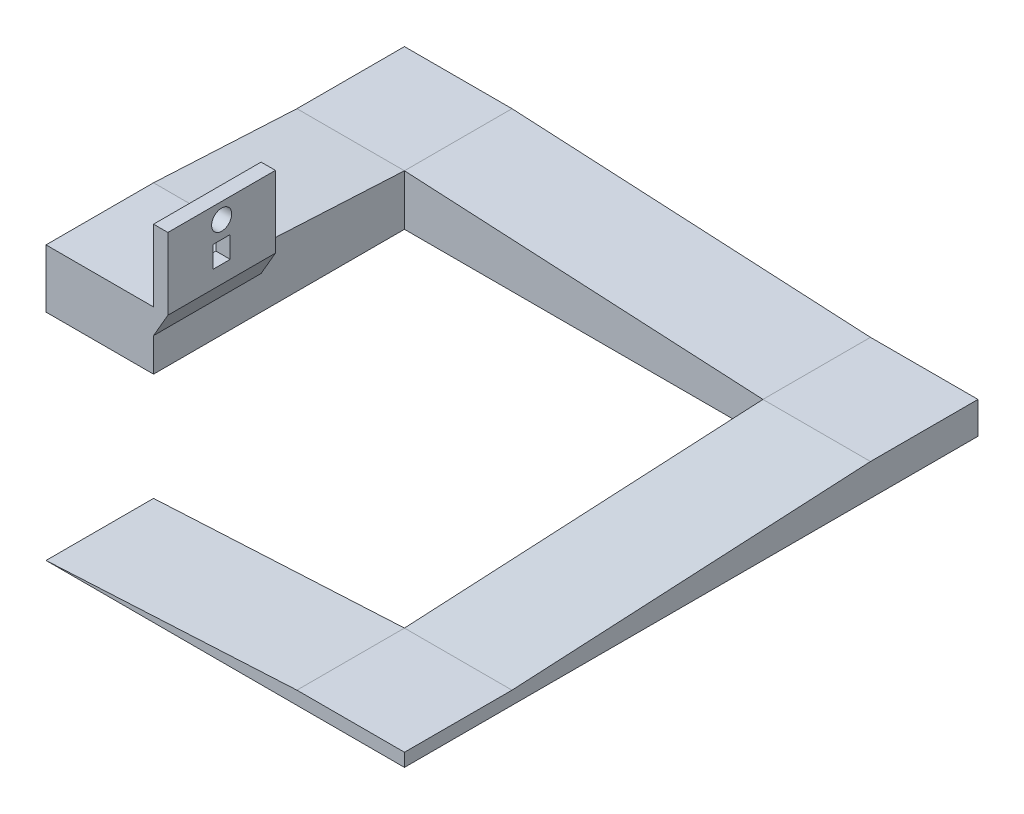
ISO-10303-21;
HEADER;
FILE_DESCRIPTION(('STEP AP214'),'2;1');
FILE_NAME('part.step','',(''),(''),'','','');
FILE_SCHEMA(('AUTOMOTIVE_DESIGN { 1 0 10303 214 1 1 1 1 }'));
ENDSEC;
DATA;
#1=APPLICATION_CONTEXT('core data for automotive mechanical design processes');
#2=APPLICATION_PROTOCOL_DEFINITION('international standard','automotive_design',2000,#1);
#3=PRODUCT_CONTEXT('',#1,'mechanical');
#4=PRODUCT('Part','Part','',(#3));
#5=PRODUCT_RELATED_PRODUCT_CATEGORY('part','',(#4));
#6=PRODUCT_DEFINITION_FORMATION('','',#4);
#7=PRODUCT_DEFINITION_CONTEXT('part definition',#1,'design');
#8=PRODUCT_DEFINITION('design','',#6,#7);
#9=PRODUCT_DEFINITION_SHAPE('','',#8);
#10=(LENGTH_UNIT() NAMED_UNIT(*) SI_UNIT(.MILLI.,.METRE.));
#11=(NAMED_UNIT(*) PLANE_ANGLE_UNIT() SI_UNIT($,.RADIAN.));
#12=(NAMED_UNIT(*) SI_UNIT($,.STERADIAN.) SOLID_ANGLE_UNIT());
#13=UNCERTAINTY_MEASURE_WITH_UNIT(LENGTH_MEASURE(1.E-05),#10,'distance_accuracy_value','');
#14=(GEOMETRIC_REPRESENTATION_CONTEXT(3) GLOBAL_UNCERTAINTY_ASSIGNED_CONTEXT((#13)) GLOBAL_UNIT_ASSIGNED_CONTEXT((#10,
#11,#12)) REPRESENTATION_CONTEXT('',''));
#15=CARTESIAN_POINT('',(0.,0.,0.));
#16=DIRECTION('',(0.,0.,1.));
#17=DIRECTION('',(1.,0.,0.));
#18=AXIS2_PLACEMENT_3D('',#15,#16,#17);
#19=CARTESIAN_POINT('',(0.,0.,0.));
#20=DIRECTION('',(0.,0.,-1.));
#21=DIRECTION('',(-1.,0.,0.));
#22=AXIS2_PLACEMENT_3D('',#19,#20,#21);
#23=PLANE('',#22);
#24=DIRECTION('',(0.998629534754574,0.0523359562429373,0.));
#25=VECTOR('',#24,1.);
#26=CARTESIAN_POINT('',(0.,0.,0.));
#27=LINE('',#26,#25);
#28=CARTESIAN_POINT('',(0.,0.,0.));
#29=VERTEX_POINT('',#28);
#30=CARTESIAN_POINT('',(44.45,2.32952578913089,0.));
#31=VERTEX_POINT('',#30);
#32=EDGE_CURVE('E352',#29,#31,#27,.T.);
#33=ORIENTED_EDGE('',*,*,#32,.T.);
#34=DIRECTION('',(0.,-1.,0.));
#35=VECTOR('',#34,1.);
#36=CARTESIAN_POINT('',(44.45,0.,0.));
#37=LINE('',#36,#35);
#38=CARTESIAN_POINT('',(44.45,0.,0.));
#39=VERTEX_POINT('',#38);
#40=EDGE_CURVE('E306',#31,#39,#37,.T.);
#41=ORIENTED_EDGE('',*,*,#40,.T.);
#42=DIRECTION('',(-1.,0.,0.));
#43=VECTOR('',#42,1.);
#44=CARTESIAN_POINT('',(63.5,0.,0.));
#45=LINE('',#44,#43);
#46=EDGE_CURVE('E315',#39,#29,#45,.T.);
#47=ORIENTED_EDGE('',*,*,#46,.T.);
#48=EDGE_LOOP('',(#33,#41,#47));
#49=FACE_BOUND('',#48,.T.);
#50=ADVANCED_FACE('F35',(#49),#23,.T.);
#51=CARTESIAN_POINT('',(63.5,2.32952578913089,19.05));
#52=DIRECTION('',(1.,0.,0.));
#53=DIRECTION('',(0.,0.,-1.));
#54=AXIS2_PLACEMENT_3D('',#51,#52,#53);
#55=PLANE('',#54);
#56=DIRECTION('',(0.,0.,-1.));
#57=VECTOR('',#56,1.);
#58=CARTESIAN_POINT('',(63.5,0.,19.05));
#59=LINE('',#58,#57);
#60=CARTESIAN_POINT('',(63.5,0.,19.05));
#61=VERTEX_POINT('',#60);
#62=CARTESIAN_POINT('',(63.5,0.,-82.55));
#63=VERTEX_POINT('',#62);
#64=EDGE_CURVE('E349',#61,#63,#59,.T.);
#65=ORIENTED_EDGE('',*,*,#64,.T.);
#66=DIRECTION('',(0.,1.,0.));
#67=VECTOR('',#66,1.);
#68=CARTESIAN_POINT('',(63.5,5.65741977360359,-82.55));
#69=LINE('',#68,#67);
#70=CARTESIAN_POINT('',(63.5,5.65741977360359,-82.55));
#71=VERTEX_POINT('',#70);
#72=EDGE_CURVE('E295',#63,#71,#69,.T.);
#73=ORIENTED_EDGE('',*,*,#72,.T.);
#74=DIRECTION('',(0.,0.,1.));
#75=VECTOR('',#74,1.);
#76=CARTESIAN_POINT('',(63.5,5.65741977360359,-63.5));
#77=LINE('',#76,#75);
#78=CARTESIAN_POINT('',(63.5,5.65741977360359,-63.5));
#79=VERTEX_POINT('',#78);
#80=EDGE_CURVE('E324',#71,#79,#77,.T.);
#81=ORIENTED_EDGE('',*,*,#80,.T.);
#82=DIRECTION('',(0.,-0.0523359562429373,0.998629534754574));
#83=VECTOR('',#82,1.);
#84=CARTESIAN_POINT('',(63.5,2.32952578913089,0.));
#85=LINE('',#84,#83);
#86=CARTESIAN_POINT('',(63.5,2.32952578913089,0.));
#87=VERTEX_POINT('',#86);
#88=EDGE_CURVE('E319',#79,#87,#85,.T.);
#89=ORIENTED_EDGE('',*,*,#88,.T.);
#90=DIRECTION('',(0.,0.,-1.));
#91=VECTOR('',#90,1.);
#92=CARTESIAN_POINT('',(63.5,2.32952578913089,19.05));
#93=LINE('',#92,#91);
#94=CARTESIAN_POINT('',(63.5,2.32952578913089,19.05));
#95=VERTEX_POINT('',#94);
#96=EDGE_CURVE('E43',#95,#87,#93,.T.);
#97=ORIENTED_EDGE('',*,*,#96,.F.);
#98=DIRECTION('',(0.,-1.,0.));
#99=VECTOR('',#98,1.);
#100=CARTESIAN_POINT('',(63.5,2.32952578913089,19.05));
#101=LINE('',#100,#99);
#102=EDGE_CURVE('E337',#95,#61,#101,.T.);
#103=ORIENTED_EDGE('',*,*,#102,.T.);
#104=EDGE_LOOP('',(#65,#73,#81,#89,#97,#103));
#105=FACE_BOUND('',#104,.T.);
#106=ADVANCED_FACE('F37',(#105),#55,.T.);
#107=CARTESIAN_POINT('',(44.45,2.32952578913089,19.05));
#108=DIRECTION('',(0.,1.,0.));
#109=DIRECTION('',(0.,0.,1.));
#110=AXIS2_PLACEMENT_3D('',#107,#108,#109);
#111=PLANE('',#110);
#112=DIRECTION('',(1.,0.,0.));
#113=VECTOR('',#112,1.);
#114=CARTESIAN_POINT('',(44.45,2.32952578913089,0.));
#115=LINE('',#114,#113);
#116=EDGE_CURVE('E341',#31,#87,#115,.T.);
#117=ORIENTED_EDGE('',*,*,#116,.F.);
#118=DIRECTION('',(0.,0.,-1.));
#119=VECTOR('',#118,1.);
#120=CARTESIAN_POINT('',(44.45,2.32952578913089,19.05));
#121=LINE('',#120,#119);
#122=CARTESIAN_POINT('',(44.45,2.32952578913089,19.05));
#123=VERTEX_POINT('',#122);
#124=EDGE_CURVE('E357',#123,#31,#121,.T.);
#125=ORIENTED_EDGE('',*,*,#124,.F.);
#126=DIRECTION('',(1.,0.,0.));
#127=VECTOR('',#126,1.);
#128=CARTESIAN_POINT('',(44.45,2.32952578913089,19.05));
#129=LINE('',#128,#127);
#130=EDGE_CURVE('E347',#123,#95,#129,.T.);
#131=ORIENTED_EDGE('',*,*,#130,.T.);
#132=ORIENTED_EDGE('',*,*,#96,.T.);
#133=EDGE_LOOP('',(#117,#125,#131,#132));
#134=FACE_BOUND('',#133,.T.);
#135=ADVANCED_FACE('F383',(#134),#111,.T.);
#136=CARTESIAN_POINT('',(0.,0.,19.05));
#137=DIRECTION('',(-0.0523359562429373,0.998629534754574,0.));
#138=DIRECTION('',(-0.998629534754574,-0.0523359562429373,0.));
#139=AXIS2_PLACEMENT_3D('',#136,#137,#138);
#140=PLANE('',#139);
#141=ORIENTED_EDGE('',*,*,#32,.F.);
#142=DIRECTION('',(0.,0.,-1.));
#143=VECTOR('',#142,1.);
#144=CARTESIAN_POINT('',(0.,0.,19.05));
#145=LINE('',#144,#143);
#146=CARTESIAN_POINT('',(0.,0.,19.05));
#147=VERTEX_POINT('',#146);
#148=EDGE_CURVE('E360',#147,#29,#145,.T.);
#149=ORIENTED_EDGE('',*,*,#148,.F.);
#150=DIRECTION('',(0.998629534754574,0.0523359562429373,0.));
#151=VECTOR('',#150,1.);
#152=CARTESIAN_POINT('',(0.,0.,19.05));
#153=LINE('',#152,#151);
#154=EDGE_CURVE('E344',#147,#123,#153,.T.);
#155=ORIENTED_EDGE('',*,*,#154,.T.);
#156=ORIENTED_EDGE('',*,*,#124,.T.);
#157=EDGE_LOOP('',(#141,#149,#155,#156));
#158=FACE_BOUND('',#157,.T.);
#159=ADVANCED_FACE('F390',(#158),#140,.T.);
#160=CARTESIAN_POINT('',(63.5,0.,19.05));
#161=DIRECTION('',(0.,-1.,0.));
#162=DIRECTION('',(1.,0.,0.));
#163=AXIS2_PLACEMENT_3D('',#160,#161,#162);
#164=PLANE('',#163);
#165=ORIENTED_EDGE('',*,*,#46,.F.);
#166=DIRECTION('',(0.,0.,-1.));
#167=VECTOR('',#166,1.);
#168=CARTESIAN_POINT('',(44.45,0.,-82.55));
#169=LINE('',#168,#167);
#170=CARTESIAN_POINT('',(44.45,0.,-63.5));
#171=VERTEX_POINT('',#170);
#172=EDGE_CURVE('E304',#39,#171,#169,.T.);
#173=ORIENTED_EDGE('',*,*,#172,.T.);
#174=DIRECTION('',(-1.,0.,0.));
#175=VECTOR('',#174,1.);
#176=CARTESIAN_POINT('',(-38.1,0.,-63.5));
#177=LINE('',#176,#175);
#178=CARTESIAN_POINT('',(-19.05,0.,-63.5));
#179=VERTEX_POINT('',#178);
#180=EDGE_CURVE('E274',#171,#179,#177,.T.);
#181=ORIENTED_EDGE('',*,*,#180,.T.);
#182=DIRECTION('',(0.,0.,1.));
#183=VECTOR('',#182,1.);
#184=CARTESIAN_POINT('',(-19.05,0.,-19.05));
#185=LINE('',#184,#183);
#186=CARTESIAN_POINT('',(-19.05,0.,-19.05));
#187=VERTEX_POINT('',#186);
#188=EDGE_CURVE('E247',#179,#187,#185,.T.);
#189=ORIENTED_EDGE('',*,*,#188,.T.);
#190=DIRECTION('',(-1.,0.,0.));
#191=VECTOR('',#190,1.);
#192=CARTESIAN_POINT('',(-19.05,0.,-19.05));
#193=LINE('',#192,#191);
#194=CARTESIAN_POINT('',(-38.1,0.,-19.05));
#195=VERTEX_POINT('',#194);
#196=EDGE_CURVE('E260',#187,#195,#193,.T.);
#197=ORIENTED_EDGE('',*,*,#196,.T.);
#198=DIRECTION('',(0.,0.,-1.));
#199=VECTOR('',#198,1.);
#200=CARTESIAN_POINT('',(-38.1,0.,-63.5));
#201=LINE('',#200,#199);
#202=CARTESIAN_POINT('',(-38.1,0.,-82.55));
#203=VERTEX_POINT('',#202);
#204=EDGE_CURVE('E286',#195,#203,#201,.T.);
#205=ORIENTED_EDGE('',*,*,#204,.T.);
#206=DIRECTION('',(1.,0.,0.));
#207=VECTOR('',#206,1.);
#208=CARTESIAN_POINT('',(44.45,0.,-82.55));
#209=LINE('',#208,#207);
#210=EDGE_CURVE('E314',#203,#63,#209,.T.);
#211=ORIENTED_EDGE('',*,*,#210,.T.);
#212=ORIENTED_EDGE('',*,*,#64,.F.);
#213=DIRECTION('',(-1.,0.,0.));
#214=VECTOR('',#213,1.);
#215=CARTESIAN_POINT('',(63.5,0.,19.05));
#216=LINE('',#215,#214);
#217=EDGE_CURVE('E340',#61,#147,#216,.T.);
#218=ORIENTED_EDGE('',*,*,#217,.T.);
#219=ORIENTED_EDGE('',*,*,#148,.T.);
#220=EDGE_LOOP('',(#165,#173,#181,#189,#197,#205,#211,#212,#218,#219));
#221=FACE_BOUND('',#220,.T.);
#222=ADVANCED_FACE('F366',(#221),#164,.T.);
#223=CARTESIAN_POINT('',(0.,0.,19.05));
#224=DIRECTION('',(0.,0.,-1.));
#225=DIRECTION('',(-1.,0.,0.));
#226=AXIS2_PLACEMENT_3D('',#223,#224,#225);
#227=PLANE('',#226);
#228=ORIENTED_EDGE('',*,*,#102,.F.);
#229=ORIENTED_EDGE('',*,*,#130,.F.);
#230=ORIENTED_EDGE('',*,*,#154,.F.);
#231=ORIENTED_EDGE('',*,*,#217,.F.);
#232=EDGE_LOOP('',(#228,#229,#230,#231));
#233=FACE_BOUND('',#232,.T.);
#234=ADVANCED_FACE('F386',(#233),#227,.F.);
#235=CARTESIAN_POINT('',(44.45,2.32952578913089,0.));
#236=DIRECTION('',(0.,0.998629534754574,0.0523359562429373));
#237=DIRECTION('',(0.,-0.0523359562429373,0.998629534754574));
#238=AXIS2_PLACEMENT_3D('',#235,#236,#237);
#239=PLANE('',#238);
#240=ORIENTED_EDGE('',*,*,#88,.F.);
#241=DIRECTION('',(1.,0.,0.));
#242=VECTOR('',#241,1.);
#243=CARTESIAN_POINT('',(44.45,5.65741977360359,-63.5));
#244=LINE('',#243,#242);
#245=CARTESIAN_POINT('',(44.45,5.65741977360359,-63.5));
#246=VERTEX_POINT('',#245);
#247=EDGE_CURVE('E331',#246,#79,#244,.T.);
#248=ORIENTED_EDGE('',*,*,#247,.F.);
#249=DIRECTION('',(0.,-0.0523359562429373,0.998629534754574));
#250=VECTOR('',#249,1.);
#251=CARTESIAN_POINT('',(44.45,2.32952578913089,0.));
#252=LINE('',#251,#250);
#253=EDGE_CURVE('E303',#246,#31,#252,.T.);
#254=ORIENTED_EDGE('',*,*,#253,.T.);
#255=ORIENTED_EDGE('',*,*,#116,.T.);
#256=EDGE_LOOP('',(#240,#248,#254,#255));
#257=FACE_BOUND('',#256,.T.);
#258=ADVANCED_FACE('F379',(#257),#239,.T.);
#259=CARTESIAN_POINT('',(44.45,5.65741977360359,-63.5));
#260=DIRECTION('',(0.,1.,0.));
#261=DIRECTION('',(0.,0.,1.));
#262=AXIS2_PLACEMENT_3D('',#259,#260,#261);
#263=PLANE('',#262);
#264=ORIENTED_EDGE('',*,*,#80,.F.);
#265=DIRECTION('',(1.,0.,0.));
#266=VECTOR('',#265,1.);
#267=CARTESIAN_POINT('',(44.45,5.65741977360359,-82.55));
#268=LINE('',#267,#266);
#269=CARTESIAN_POINT('',(44.45,5.65741977360359,-82.55));
#270=VERTEX_POINT('',#269);
#271=EDGE_CURVE('E333',#270,#71,#268,.T.);
#272=ORIENTED_EDGE('',*,*,#271,.F.);
#273=DIRECTION('',(0.,0.,1.));
#274=VECTOR('',#273,1.);
#275=CARTESIAN_POINT('',(44.45,5.65741977360359,-63.5));
#276=LINE('',#275,#274);
#277=EDGE_CURVE('E300',#270,#246,#276,.T.);
#278=ORIENTED_EDGE('',*,*,#277,.T.);
#279=ORIENTED_EDGE('',*,*,#247,.T.);
#280=EDGE_LOOP('',(#264,#272,#278,#279));
#281=FACE_BOUND('',#280,.T.);
#282=ADVANCED_FACE('F375',(#281),#263,.T.);
#283=CARTESIAN_POINT('',(44.45,5.65741977360359,-82.55));
#284=DIRECTION('',(0.,0.,-1.));
#285=DIRECTION('',(-1.,0.,0.));
#286=AXIS2_PLACEMENT_3D('',#283,#284,#285);
#287=PLANE('',#286);
#288=ORIENTED_EDGE('',*,*,#72,.F.);
#289=ORIENTED_EDGE('',*,*,#210,.F.);
#290=DIRECTION('',(0.,1.,0.));
#291=VECTOR('',#290,1.);
#292=CARTESIAN_POINT('',(-38.1,8.98531375807628,-82.55));
#293=LINE('',#292,#291);
#294=CARTESIAN_POINT('',(-38.1,8.98531375807628,-82.55));
#295=VERTEX_POINT('',#294);
#296=EDGE_CURVE('E269',#203,#295,#293,.T.);
#297=ORIENTED_EDGE('',*,*,#296,.T.);
#298=DIRECTION('',(1.,0.,0.));
#299=VECTOR('',#298,1.);
#300=CARTESIAN_POINT('',(-19.05,8.98531375807628,-82.55));
#301=LINE('',#300,#299);
#302=CARTESIAN_POINT('',(-19.05,8.98531375807628,-82.55));
#303=VERTEX_POINT('',#302);
#304=EDGE_CURVE('E289',#295,#303,#301,.T.);
#305=ORIENTED_EDGE('',*,*,#304,.T.);
#306=DIRECTION('',(0.998629534754574,-0.0523359562429372,0.));
#307=VECTOR('',#306,1.);
#308=CARTESIAN_POINT('',(44.45,5.65741977360359,-82.55));
#309=LINE('',#308,#307);
#310=EDGE_CURVE('E278',#303,#270,#309,.T.);
#311=ORIENTED_EDGE('',*,*,#310,.T.);
#312=ORIENTED_EDGE('',*,*,#271,.T.);
#313=EDGE_LOOP('',(#288,#289,#297,#305,#311,#312));
#314=FACE_BOUND('',#313,.T.);
#315=ADVANCED_FACE('F369',(#314),#287,.T.);
#316=CARTESIAN_POINT('',(44.45,0.,0.));
#317=DIRECTION('',(-1.,0.,0.));
#318=DIRECTION('',(0.,0.,1.));
#319=AXIS2_PLACEMENT_3D('',#316,#317,#318);
#320=PLANE('',#319);
#321=DIRECTION('',(0.,-1.,0.));
#322=VECTOR('',#321,1.);
#323=CARTESIAN_POINT('',(44.45,0.,-63.5));
#324=LINE('',#323,#322);
#325=EDGE_CURVE('E283',#246,#171,#324,.T.);
#326=ORIENTED_EDGE('',*,*,#325,.T.);
#327=ORIENTED_EDGE('',*,*,#172,.F.);
#328=ORIENTED_EDGE('',*,*,#40,.F.);
#329=ORIENTED_EDGE('',*,*,#253,.F.);
#330=EDGE_LOOP('',(#326,#327,#328,#329));
#331=FACE_BOUND('',#330,.T.);
#332=ADVANCED_FACE('F393',(#331),#320,.T.);
#333=CARTESIAN_POINT('',(44.45,5.65741977360359,-63.5));
#334=DIRECTION('',(0.0523359562429372,0.998629534754574,0.));
#335=DIRECTION('',(-0.998629534754574,0.0523359562429373,0.));
#336=AXIS2_PLACEMENT_3D('',#333,#334,#335);
#337=PLANE('',#336);
#338=ORIENTED_EDGE('',*,*,#310,.F.);
#339=DIRECTION('',(0.,0.,-1.));
#340=VECTOR('',#339,1.);
#341=CARTESIAN_POINT('',(-19.05,8.98531375807628,-63.5));
#342=LINE('',#341,#340);
#343=CARTESIAN_POINT('',(-19.05,8.98531375807628,-63.5));
#344=VERTEX_POINT('',#343);
#345=EDGE_CURVE('E293',#344,#303,#342,.T.);
#346=ORIENTED_EDGE('',*,*,#345,.F.);
#347=DIRECTION('',(0.998629534754574,-0.0523359562429372,0.));
#348=VECTOR('',#347,1.);
#349=CARTESIAN_POINT('',(44.45,5.65741977360359,-63.5));
#350=LINE('',#349,#348);
#351=EDGE_CURVE('E281',#344,#246,#350,.T.);
#352=ORIENTED_EDGE('',*,*,#351,.T.);
#353=ORIENTED_EDGE('',*,*,#277,.F.);
#354=EDGE_LOOP('',(#338,#346,#352,#353));
#355=FACE_BOUND('',#354,.T.);
#356=ADVANCED_FACE('F419',(#355),#337,.T.);
#357=CARTESIAN_POINT('',(-19.05,8.98531375807628,-63.5));
#358=DIRECTION('',(0.,1.,0.));
#359=DIRECTION('',(0.,0.,1.));
#360=AXIS2_PLACEMENT_3D('',#357,#358,#359);
#361=PLANE('',#360);
#362=ORIENTED_EDGE('',*,*,#304,.F.);
#363=DIRECTION('',(0.,0.,-1.));
#364=VECTOR('',#363,1.);
#365=CARTESIAN_POINT('',(-38.1,8.98531375807628,-63.5));
#366=LINE('',#365,#364);
#367=CARTESIAN_POINT('',(-38.1,8.98531375807628,-63.5));
#368=VERTEX_POINT('',#367);
#369=EDGE_CURVE('E296',#368,#295,#366,.T.);
#370=ORIENTED_EDGE('',*,*,#369,.F.);
#371=DIRECTION('',(1.,0.,0.));
#372=VECTOR('',#371,1.);
#373=CARTESIAN_POINT('',(-19.05,8.98531375807628,-63.5));
#374=LINE('',#373,#372);
#375=EDGE_CURVE('E277',#368,#344,#374,.T.);
#376=ORIENTED_EDGE('',*,*,#375,.T.);
#377=ORIENTED_EDGE('',*,*,#345,.T.);
#378=EDGE_LOOP('',(#362,#370,#376,#377));
#379=FACE_BOUND('',#378,.T.);
#380=ADVANCED_FACE('F415',(#379),#361,.T.);
#381=CARTESIAN_POINT('',(-38.1,8.98531375807628,-63.5));
#382=DIRECTION('',(-1.,0.,0.));
#383=DIRECTION('',(0.,0.,1.));
#384=AXIS2_PLACEMENT_3D('',#381,#382,#383);
#385=PLANE('',#384);
#386=ORIENTED_EDGE('',*,*,#296,.F.);
#387=ORIENTED_EDGE('',*,*,#204,.F.);
#388=DIRECTION('',(0.,1.,0.));
#389=VECTOR('',#388,1.);
#390=CARTESIAN_POINT('',(-38.1,10.3164713518654,-19.05));
#391=LINE('',#390,#389);
#392=CARTESIAN_POINT('',(-38.1,10.3164713518654,-19.05));
#393=VERTEX_POINT('',#392);
#394=EDGE_CURVE('E237',#195,#393,#391,.T.);
#395=ORIENTED_EDGE('',*,*,#394,.T.);
#396=DIRECTION('',(0.,0.,-1.));
#397=VECTOR('',#396,1.);
#398=CARTESIAN_POINT('',(-38.1,10.3164713518654,-38.1));
#399=LINE('',#398,#397);
#400=CARTESIAN_POINT('',(-38.1,10.3164713518654,-38.1));
#401=VERTEX_POINT('',#400);
#402=EDGE_CURVE('E263',#393,#401,#399,.T.);
#403=ORIENTED_EDGE('',*,*,#402,.T.);
#404=DIRECTION('',(0.,-0.0523359562429373,-0.998629534754574));
#405=VECTOR('',#404,1.);
#406=CARTESIAN_POINT('',(-38.1,8.98531375807628,-63.5));
#407=LINE('',#406,#405);
#408=EDGE_CURVE('E248',#401,#368,#407,.T.);
#409=ORIENTED_EDGE('',*,*,#408,.T.);
#410=ORIENTED_EDGE('',*,*,#369,.T.);
#411=EDGE_LOOP('',(#386,#387,#395,#403,#409,#410));
#412=FACE_BOUND('',#411,.T.);
#413=ADVANCED_FACE('F410',(#412),#385,.T.);
#414=CARTESIAN_POINT('',(0.,0.,-63.5));
#415=DIRECTION('',(0.,0.,1.));
#416=DIRECTION('',(1.,0.,0.));
#417=AXIS2_PLACEMENT_3D('',#414,#415,#416);
#418=PLANE('',#417);
#419=DIRECTION('',(0.,-1.,0.));
#420=VECTOR('',#419,1.);
#421=CARTESIAN_POINT('',(-19.05,0.,-63.5));
#422=LINE('',#421,#420);
#423=EDGE_CURVE('E244',#344,#179,#422,.T.);
#424=ORIENTED_EDGE('',*,*,#423,.T.);
#425=ORIENTED_EDGE('',*,*,#180,.F.);
#426=ORIENTED_EDGE('',*,*,#325,.F.);
#427=ORIENTED_EDGE('',*,*,#351,.F.);
#428=EDGE_LOOP('',(#424,#425,#426,#427));
#429=FACE_BOUND('',#428,.T.);
#430=ADVANCED_FACE('F397',(#429),#418,.T.);
#431=CARTESIAN_POINT('',(-19.05,8.98531375807628,-63.5));
#432=DIRECTION('',(0.,0.998629534754574,-0.0523359562429373));
#433=DIRECTION('',(0.,0.0523359562429373,0.998629534754574));
#434=AXIS2_PLACEMENT_3D('',#431,#432,#433);
#435=PLANE('',#434);
#436=ORIENTED_EDGE('',*,*,#408,.F.);
#437=DIRECTION('',(-1.,0.,0.));
#438=VECTOR('',#437,1.);
#439=CARTESIAN_POINT('',(-19.05,10.3164713518654,-38.1));
#440=LINE('',#439,#438);
#441=CARTESIAN_POINT('',(-19.05,10.3164713518654,-38.1));
#442=VERTEX_POINT('',#441);
#443=EDGE_CURVE('E267',#442,#401,#440,.T.);
#444=ORIENTED_EDGE('',*,*,#443,.F.);
#445=DIRECTION('',(0.,-0.0523359562429373,-0.998629534754574));
#446=VECTOR('',#445,1.);
#447=CARTESIAN_POINT('',(-19.05,8.98531375807628,-63.5));
#448=LINE('',#447,#446);
#449=EDGE_CURVE('E257',#442,#344,#448,.T.);
#450=ORIENTED_EDGE('',*,*,#449,.T.);
#451=ORIENTED_EDGE('',*,*,#375,.F.);
#452=EDGE_LOOP('',(#436,#444,#450,#451));
#453=FACE_BOUND('',#452,.T.);
#454=ADVANCED_FACE('F496',(#453),#435,.T.);
#455=CARTESIAN_POINT('',(-19.05,10.3164713518654,-38.1));
#456=DIRECTION('',(0.,1.,0.));
#457=DIRECTION('',(0.,0.,1.));
#458=AXIS2_PLACEMENT_3D('',#455,#456,#457);
#459=PLANE('',#458);
#460=ORIENTED_EDGE('',*,*,#402,.F.);
#461=DIRECTION('',(-1.,0.,0.));
#462=VECTOR('',#461,1.);
#463=CARTESIAN_POINT('',(-19.05,10.3164713518654,-19.05));
#464=LINE('',#463,#462);
#465=CARTESIAN_POINT('',(-19.05,10.3164713518654,-19.05));
#466=VERTEX_POINT('',#465);
#467=EDGE_CURVE('E270',#466,#393,#464,.T.);
#468=ORIENTED_EDGE('',*,*,#467,.F.);
#469=DIRECTION('',(0.,0.,-1.));
#470=VECTOR('',#469,1.);
#471=CARTESIAN_POINT('',(-19.05,10.3164713518654,-38.1));
#472=LINE('',#471,#470);
#473=EDGE_CURVE('E254',#466,#442,#472,.T.);
#474=ORIENTED_EDGE('',*,*,#473,.T.);
#475=ORIENTED_EDGE('',*,*,#443,.T.);
#476=EDGE_LOOP('',(#460,#468,#474,#475));
#477=FACE_BOUND('',#476,.T.);
#478=ADVANCED_FACE('F503',(#477),#459,.T.);
#479=CARTESIAN_POINT('',(-19.05,10.3164713518654,-19.05));
#480=DIRECTION('',(0.,0.,1.));
#481=DIRECTION('',(1.,0.,0.));
#482=AXIS2_PLACEMENT_3D('',#479,#480,#481);
#483=PLANE('',#482);
#484=ORIENTED_EDGE('',*,*,#394,.F.);
#485=ORIENTED_EDGE('',*,*,#196,.F.);
#486=DIRECTION('',(0.,1.,0.));
#487=VECTOR('',#486,1.);
#488=CARTESIAN_POINT('',(-19.05,10.3164713518654,-19.05));
#489=LINE('',#488,#487);
#490=CARTESIAN_POINT('',(-19.05,5.91706230064037,-19.05));
#491=VERTEX_POINT('',#490);
#492=EDGE_CURVE('E251',#187,#491,#489,.T.);
#493=ORIENTED_EDGE('',*,*,#492,.T.);
#494=DIRECTION('',(0.499999999999995,0.866025403784441,0.));
#495=VECTOR('',#494,1.);
#496=CARTESIAN_POINT('',(-16.51,10.3164713518654,-19.05));
#497=LINE('',#496,#495);
#498=CARTESIAN_POINT('',(-16.51,10.3164713518654,-19.05));
#499=VERTEX_POINT('',#498);
#500=EDGE_CURVE('E230',#491,#499,#497,.T.);
#501=ORIENTED_EDGE('',*,*,#500,.T.);
#502=DIRECTION('',(0.,1.,0.));
#503=VECTOR('',#502,1.);
#504=CARTESIAN_POINT('',(-16.51,23.0164713518654,-19.05));
#505=LINE('',#504,#503);
#506=CARTESIAN_POINT('',(-16.51,23.0164713518654,-19.05));
#507=VERTEX_POINT('',#506);
#508=EDGE_CURVE('E216',#499,#507,#505,.T.);
#509=ORIENTED_EDGE('',*,*,#508,.T.);
#510=DIRECTION('',(-1.,0.,0.));
#511=VECTOR('',#510,1.);
#512=CARTESIAN_POINT('',(-19.05,23.0164713518654,-19.05));
#513=LINE('',#512,#511);
#514=CARTESIAN_POINT('',(-19.05,23.0164713518654,-19.05));
#515=VERTEX_POINT('',#514);
#516=EDGE_CURVE('E183',#507,#515,#513,.T.);
#517=ORIENTED_EDGE('',*,*,#516,.T.);
#518=DIRECTION('',(0.,-1.,0.));
#519=VECTOR('',#518,1.);
#520=CARTESIAN_POINT('',(-19.05,5.91706230064037,-19.05));
#521=LINE('',#520,#519);
#522=EDGE_CURVE('E228',#515,#466,#521,.T.);
#523=ORIENTED_EDGE('',*,*,#522,.T.);
#524=ORIENTED_EDGE('',*,*,#467,.T.);
#525=EDGE_LOOP('',(#484,#485,#493,#501,#509,#517,#523,#524));
#526=FACE_BOUND('',#525,.T.);
#527=ADVANCED_FACE('F405',(#526),#483,.T.);
#528=CARTESIAN_POINT('',(-19.05,0.,0.));
#529=DIRECTION('',(1.,0.,0.));
#530=DIRECTION('',(0.,0.,-1.));
#531=AXIS2_PLACEMENT_3D('',#528,#529,#530);
#532=PLANE('',#531);
#533=DIRECTION('',(0.,0.,1.));
#534=VECTOR('',#533,1.);
#535=CARTESIAN_POINT('',(-19.05,5.91706230064037,-38.1));
#536=LINE('',#535,#534);
#537=CARTESIAN_POINT('',(-19.05,5.91706230064037,-38.1));
#538=VERTEX_POINT('',#537);
#539=EDGE_CURVE('E240',#538,#491,#536,.T.);
#540=ORIENTED_EDGE('',*,*,#539,.T.);
#541=ORIENTED_EDGE('',*,*,#492,.F.);
#542=ORIENTED_EDGE('',*,*,#188,.F.);
#543=ORIENTED_EDGE('',*,*,#423,.F.);
#544=ORIENTED_EDGE('',*,*,#449,.F.);
#545=DIRECTION('',(0.,1.,0.));
#546=VECTOR('',#545,1.);
#547=CARTESIAN_POINT('',(-19.05,0.,-38.1));
#548=LINE('',#547,#546);
#549=EDGE_CURVE('E11',#538,#442,#548,.T.);
#550=ORIENTED_EDGE('',*,*,#549,.F.);
#551=EDGE_LOOP('',(#540,#541,#542,#543,#544,#550));
#552=FACE_BOUND('',#551,.T.);
#553=ADVANCED_FACE('F401',(#552),#532,.T.);
#554=CARTESIAN_POINT('',(-19.05,23.0164713518654,-38.1));
#555=DIRECTION('',(0.,1.,0.));
#556=DIRECTION('',(-1.,0.,0.));
#557=AXIS2_PLACEMENT_3D('',#554,#555,#556);
#558=PLANE('',#557);
#559=ORIENTED_EDGE('',*,*,#516,.F.);
#560=DIRECTION('',(0.,0.,1.));
#561=VECTOR('',#560,1.);
#562=CARTESIAN_POINT('',(-16.51,23.0164713518654,-38.1));
#563=LINE('',#562,#561);
#564=CARTESIAN_POINT('',(-16.51,23.0164713518654,-38.1));
#565=VERTEX_POINT('',#564);
#566=EDGE_CURVE('E235',#565,#507,#563,.T.);
#567=ORIENTED_EDGE('',*,*,#566,.F.);
#568=DIRECTION('',(-1.,0.,0.));
#569=VECTOR('',#568,1.);
#570=CARTESIAN_POINT('',(-19.05,23.0164713518654,-38.1));
#571=LINE('',#570,#569);
#572=CARTESIAN_POINT('',(-19.05,23.0164713518654,-38.1));
#573=VERTEX_POINT('',#572);
#574=EDGE_CURVE('E212',#565,#573,#571,.T.);
#575=ORIENTED_EDGE('',*,*,#574,.T.);
#576=DIRECTION('',(0.,0.,1.));
#577=VECTOR('',#576,1.);
#578=CARTESIAN_POINT('',(-19.05,23.0164713518654,-38.1));
#579=LINE('',#578,#577);
#580=EDGE_CURVE('E225',#573,#515,#579,.T.);
#581=ORIENTED_EDGE('',*,*,#580,.T.);
#582=EDGE_LOOP('',(#559,#567,#575,#581));
#583=FACE_BOUND('',#582,.T.);
#584=ADVANCED_FACE('F532',(#583),#558,.T.);
#585=CARTESIAN_POINT('',(-16.51,23.0164713518654,-38.1));
#586=DIRECTION('',(1.,0.,0.));
#587=DIRECTION('',(0.,0.,-1.));
#588=AXIS2_PLACEMENT_3D('',#585,#586,#587);
#589=PLANE('',#588);
#590=CARTESIAN_POINT('',(-16.51,20.2224713518654,-28.575));
#591=DIRECTION('',(1.,0.,0.));
#592=DIRECTION('',(0.,0.,-1.));
#593=AXIS2_PLACEMENT_3D('',#590,#591,#592);
#594=CIRCLE('',#593,1.778);
#595=CARTESIAN_POINT('',(-16.51,20.2224713518654,-30.353));
#596=VERTEX_POINT('',#595);
#597=EDGE_CURVE('E632',#596,#596,#594,.F.);
#598=ORIENTED_EDGE('',*,*,#597,.T.);
#599=EDGE_LOOP('',(#598));
#600=FACE_BOUND('',#599,.T.);
#601=DIRECTION('',(0.,-1.,0.));
#602=VECTOR('',#601,1.);
#603=CARTESIAN_POINT('',(-16.51,17.1744713518654,-30.099));
#604=LINE('',#603,#602);
#605=CARTESIAN_POINT('',(-16.51,17.1744713518654,-30.099));
#606=VERTEX_POINT('',#605);
#607=CARTESIAN_POINT('',(-16.51,13.3644713518654,-30.099));
#608=VERTEX_POINT('',#607);
#609=EDGE_CURVE('E187',#606,#608,#604,.T.);
#610=ORIENTED_EDGE('',*,*,#609,.T.);
#611=DIRECTION('',(0.,0.,1.));
#612=VECTOR('',#611,1.);
#613=CARTESIAN_POINT('',(-16.51,13.3644713518654,-30.099));
#614=LINE('',#613,#612);
#615=CARTESIAN_POINT('',(-16.51,13.3644713518654,-27.051));
#616=VERTEX_POINT('',#615);
#617=EDGE_CURVE('E176',#608,#616,#614,.T.);
#618=ORIENTED_EDGE('',*,*,#617,.T.);
#619=DIRECTION('',(0.,1.,0.));
#620=VECTOR('',#619,1.);
#621=CARTESIAN_POINT('',(-16.51,17.1744713518654,-27.051));
#622=LINE('',#621,#620);
#623=CARTESIAN_POINT('',(-16.51,17.1744713518654,-27.051));
#624=VERTEX_POINT('',#623);
#625=EDGE_CURVE('E198',#616,#624,#622,.T.);
#626=ORIENTED_EDGE('',*,*,#625,.T.);
#627=DIRECTION('',(0.,0.,-1.));
#628=VECTOR('',#627,1.);
#629=CARTESIAN_POINT('',(-16.51,17.1744713518654,-30.099));
#630=LINE('',#629,#628);
#631=EDGE_CURVE('E194',#624,#606,#630,.T.);
#632=ORIENTED_EDGE('',*,*,#631,.T.);
#633=EDGE_LOOP('',(#610,#618,#626,#632));
#634=FACE_BOUND('',#633,.T.);
#635=ORIENTED_EDGE('',*,*,#508,.F.);
#636=DIRECTION('',(0.,0.,1.));
#637=VECTOR('',#636,1.);
#638=CARTESIAN_POINT('',(-16.51,10.3164713518654,-38.1));
#639=LINE('',#638,#637);
#640=CARTESIAN_POINT('',(-16.51,10.3164713518654,-38.1));
#641=VERTEX_POINT('',#640);
#642=EDGE_CURVE('E238',#641,#499,#639,.T.);
#643=ORIENTED_EDGE('',*,*,#642,.F.);
#644=DIRECTION('',(0.,1.,0.));
#645=VECTOR('',#644,1.);
#646=CARTESIAN_POINT('',(-16.51,23.0164713518654,-38.1));
#647=LINE('',#646,#645);
#648=EDGE_CURVE('E222',#641,#565,#647,.T.);
#649=ORIENTED_EDGE('',*,*,#648,.T.);
#650=ORIENTED_EDGE('',*,*,#566,.T.);
#651=EDGE_LOOP('',(#635,#643,#649,#650));
#652=FACE_BOUND('',#651,.T.);
#653=ADVANCED_FACE('F192',(#600,#634,#652),#589,.T.);
#654=CARTESIAN_POINT('',(-16.51,10.3164713518654,-38.1));
#655=DIRECTION('',(0.866025403784441,-0.499999999999995,0.));
#656=DIRECTION('',(0.499999999999995,0.866025403784441,0.));
#657=AXIS2_PLACEMENT_3D('',#654,#655,#656);
#658=PLANE('',#657);
#659=ORIENTED_EDGE('',*,*,#500,.F.);
#660=ORIENTED_EDGE('',*,*,#539,.F.);
#661=DIRECTION('',(0.499999999999995,0.866025403784441,0.));
#662=VECTOR('',#661,1.);
#663=CARTESIAN_POINT('',(-16.51,10.3164713518654,-38.1));
#664=LINE('',#663,#662);
#665=EDGE_CURVE('E219',#538,#641,#664,.T.);
#666=ORIENTED_EDGE('',*,*,#665,.T.);
#667=ORIENTED_EDGE('',*,*,#642,.T.);
#668=EDGE_LOOP('',(#659,#660,#666,#667));
#669=FACE_BOUND('',#668,.T.);
#670=ADVANCED_FACE('F547',(#669),#658,.T.);
#671=CARTESIAN_POINT('',(-19.05,5.91706230064037,-38.1));
#672=DIRECTION('',(-1.,0.,0.));
#673=DIRECTION('',(0.,0.,1.));
#674=AXIS2_PLACEMENT_3D('',#671,#672,#673);
#675=PLANE('',#674);
#676=CARTESIAN_POINT('',(-19.05,20.2224713518654,-28.575));
#677=DIRECTION('',(-1.,0.,0.));
#678=DIRECTION('',(0.,0.,1.));
#679=AXIS2_PLACEMENT_3D('',#676,#677,#678);
#680=CIRCLE('',#679,1.778);
#681=CARTESIAN_POINT('',(-19.05,20.2224713518654,-26.797));
#682=VERTEX_POINT('',#681);
#683=EDGE_CURVE('E635',#682,#682,#680,.T.);
#684=ORIENTED_EDGE('',*,*,#683,.F.);
#685=EDGE_LOOP('',(#684));
#686=FACE_BOUND('',#685,.T.);
#687=DIRECTION('',(0.,-1.,0.));
#688=VECTOR('',#687,1.);
#689=CARTESIAN_POINT('',(-19.05,17.1744713518654,-30.099));
#690=LINE('',#689,#688);
#691=CARTESIAN_POINT('',(-19.05,17.1744713518654,-30.099));
#692=VERTEX_POINT('',#691);
#693=CARTESIAN_POINT('',(-19.05,13.3644713518654,-30.099));
#694=VERTEX_POINT('',#693);
#695=EDGE_CURVE('E58',#692,#694,#690,.T.);
#696=ORIENTED_EDGE('',*,*,#695,.F.);
#697=DIRECTION('',(0.,0.,-1.));
#698=VECTOR('',#697,1.);
#699=CARTESIAN_POINT('',(-19.05,17.1744713518654,-30.099));
#700=LINE('',#699,#698);
#701=CARTESIAN_POINT('',(-19.05,17.1744713518654,-27.051));
#702=VERTEX_POINT('',#701);
#703=EDGE_CURVE('E189',#702,#692,#700,.T.);
#704=ORIENTED_EDGE('',*,*,#703,.F.);
#705=DIRECTION('',(0.,1.,0.));
#706=VECTOR('',#705,1.);
#707=CARTESIAN_POINT('',(-19.05,17.1744713518654,-27.051));
#708=LINE('',#707,#706);
#709=CARTESIAN_POINT('',(-19.05,13.3644713518654,-27.051));
#710=VERTEX_POINT('',#709);
#711=EDGE_CURVE('E203',#710,#702,#708,.T.);
#712=ORIENTED_EDGE('',*,*,#711,.F.);
#713=DIRECTION('',(0.,0.,1.));
#714=VECTOR('',#713,1.);
#715=CARTESIAN_POINT('',(-19.05,13.3644713518654,-30.099));
#716=LINE('',#715,#714);
#717=EDGE_CURVE('E196',#694,#710,#716,.T.);
#718=ORIENTED_EDGE('',*,*,#717,.F.);
#719=EDGE_LOOP('',(#696,#704,#712,#718));
#720=FACE_BOUND('',#719,.T.);
#721=DIRECTION('',(0.,-1.,0.));
#722=VECTOR('',#721,1.);
#723=CARTESIAN_POINT('',(-19.05,5.91706230064037,-38.1));
#724=LINE('',#723,#722);
#725=EDGE_CURVE('E215',#573,#442,#724,.T.);
#726=ORIENTED_EDGE('',*,*,#725,.T.);
#727=ORIENTED_EDGE('',*,*,#473,.F.);
#728=ORIENTED_EDGE('',*,*,#522,.F.);
#729=ORIENTED_EDGE('',*,*,#580,.F.);
#730=EDGE_LOOP('',(#726,#727,#728,#729));
#731=FACE_BOUND('',#730,.T.);
#732=ADVANCED_FACE('F552',(#686,#720,#731),#675,.T.);
#733=CARTESIAN_POINT('',(0.,0.,-38.1));
#734=DIRECTION('',(0.,0.,-1.));
#735=DIRECTION('',(-1.,0.,0.));
#736=AXIS2_PLACEMENT_3D('',#733,#734,#735);
#737=PLANE('',#736);
#738=ORIENTED_EDGE('',*,*,#574,.F.);
#739=ORIENTED_EDGE('',*,*,#648,.F.);
#740=ORIENTED_EDGE('',*,*,#665,.F.);
#741=ORIENTED_EDGE('',*,*,#549,.T.);
#742=ORIENTED_EDGE('',*,*,#725,.F.);
#743=EDGE_LOOP('',(#738,#739,#740,#741,#742));
#744=FACE_BOUND('',#743,.T.);
#745=ADVANCED_FACE('F560',(#744),#737,.T.);
#746=CARTESIAN_POINT('',(63.501,17.1744713518654,-30.099));
#747=DIRECTION('',(0.,0.,-1.));
#748=DIRECTION('',(0.,1.,0.));
#749=AXIS2_PLACEMENT_3D('',#746,#747,#748);
#750=PLANE('',#749);
#751=DIRECTION('',(-1.,0.,0.));
#752=VECTOR('',#751,1.);
#753=CARTESIAN_POINT('',(63.501,17.1744713518654,-30.099));
#754=LINE('',#753,#752);
#755=EDGE_CURVE('E184',#606,#692,#754,.T.);
#756=ORIENTED_EDGE('',*,*,#755,.T.);
#757=ORIENTED_EDGE('',*,*,#695,.T.);
#758=DIRECTION('',(-1.,0.,0.));
#759=VECTOR('',#758,1.);
#760=CARTESIAN_POINT('',(63.501,13.3644713518654,-30.099));
#761=LINE('',#760,#759);
#762=EDGE_CURVE('E178',#608,#694,#761,.T.);
#763=ORIENTED_EDGE('',*,*,#762,.F.);
#764=ORIENTED_EDGE('',*,*,#609,.F.);
#765=EDGE_LOOP('',(#756,#757,#763,#764));
#766=FACE_BOUND('',#765,.T.);
#767=ADVANCED_FACE('F186',(#766),#750,.F.);
#768=CARTESIAN_POINT('',(63.501,17.1744713518654,-30.099));
#769=DIRECTION('',(0.,1.,0.));
#770=DIRECTION('',(0.,0.,1.));
#771=AXIS2_PLACEMENT_3D('',#768,#769,#770);
#772=PLANE('',#771);
#773=DIRECTION('',(-1.,0.,0.));
#774=VECTOR('',#773,1.);
#775=CARTESIAN_POINT('',(63.501,17.1744713518654,-27.051));
#776=LINE('',#775,#774);
#777=EDGE_CURVE('E209',#624,#702,#776,.T.);
#778=ORIENTED_EDGE('',*,*,#777,.T.);
#779=ORIENTED_EDGE('',*,*,#703,.T.);
#780=ORIENTED_EDGE('',*,*,#755,.F.);
#781=ORIENTED_EDGE('',*,*,#631,.F.);
#782=EDGE_LOOP('',(#778,#779,#780,#781));
#783=FACE_BOUND('',#782,.T.);
#784=ADVANCED_FACE('F588',(#783),#772,.F.);
#785=CARTESIAN_POINT('',(63.501,17.1744713518654,-27.051));
#786=DIRECTION('',(0.,0.,1.));
#787=DIRECTION('',(0.,-1.,0.));
#788=AXIS2_PLACEMENT_3D('',#785,#786,#787);
#789=PLANE('',#788);
#790=DIRECTION('',(-1.,0.,0.));
#791=VECTOR('',#790,1.);
#792=CARTESIAN_POINT('',(63.501,13.3644713518654,-27.051));
#793=LINE('',#792,#791);
#794=EDGE_CURVE('E50',#616,#710,#793,.T.);
#795=ORIENTED_EDGE('',*,*,#794,.T.);
#796=ORIENTED_EDGE('',*,*,#711,.T.);
#797=ORIENTED_EDGE('',*,*,#777,.F.);
#798=ORIENTED_EDGE('',*,*,#625,.F.);
#799=EDGE_LOOP('',(#795,#796,#797,#798));
#800=FACE_BOUND('',#799,.T.);
#801=ADVANCED_FACE('F597',(#800),#789,.F.);
#802=CARTESIAN_POINT('',(63.501,13.3644713518654,-30.099));
#803=DIRECTION('',(0.,-1.,0.));
#804=DIRECTION('',(0.,0.,-1.));
#805=AXIS2_PLACEMENT_3D('',#802,#803,#804);
#806=PLANE('',#805);
#807=ORIENTED_EDGE('',*,*,#762,.T.);
#808=ORIENTED_EDGE('',*,*,#717,.T.);
#809=ORIENTED_EDGE('',*,*,#794,.F.);
#810=ORIENTED_EDGE('',*,*,#617,.F.);
#811=EDGE_LOOP('',(#807,#808,#809,#810));
#812=FACE_BOUND('',#811,.T.);
#813=ADVANCED_FACE('F177',(#812),#806,.F.);
#814=CARTESIAN_POINT('',(63.501,20.2224713518654,-28.575));
#815=DIRECTION('',(-1.,0.,0.));
#816=DIRECTION('',(0.,0.,1.));
#817=AXIS2_PLACEMENT_3D('',#814,#815,#816);
#818=CYLINDRICAL_SURFACE('',#817,1.778);
#819=ORIENTED_EDGE('',*,*,#597,.F.);
#820=EDGE_LOOP('',(#819));
#821=FACE_BOUND('',#820,.T.);
#822=ORIENTED_EDGE('',*,*,#683,.T.);
#823=EDGE_LOOP('',(#822));
#824=FACE_BOUND('',#823,.T.);
#825=ADVANCED_FACE('F616',(#821,#824),#818,.F.);
#826=CLOSED_SHELL('',(#50,#106,#135,#159,#222,#234,#258,#282,#315,#332,#356,#380,#413,#430,#454,
#478,#527,#553,#584,#653,#670,#732,#745,#767,#784,#801,#813,#825));
#827=MANIFOLD_SOLID_BREP('B2',#826);
#828=ADVANCED_BREP_SHAPE_REPRESENTATION('',(#18,#827),#14);
#829=SHAPE_DEFINITION_REPRESENTATION(#9,#828);
ENDSEC;
END-ISO-10303-21;
